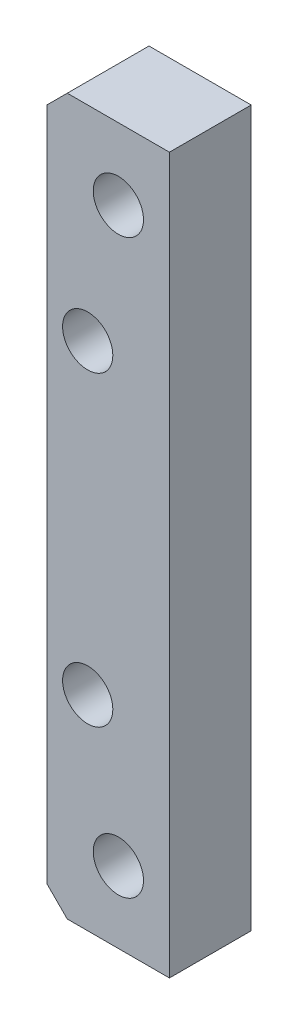
ISO-10303-21;
HEADER;
FILE_DESCRIPTION(('STEP AP214'),'2;1');
FILE_NAME('part.step','',(''),(''),'','','');
FILE_SCHEMA(('AUTOMOTIVE_DESIGN { 1 0 10303 214 1 1 1 1 }'));
ENDSEC;
DATA;
#1=APPLICATION_CONTEXT('core data for automotive mechanical design processes');
#2=APPLICATION_PROTOCOL_DEFINITION('international standard','automotive_design',2000,#1);
#3=PRODUCT_CONTEXT('',#1,'mechanical');
#4=PRODUCT('Part','Part','',(#3));
#5=PRODUCT_RELATED_PRODUCT_CATEGORY('part','',(#4));
#6=PRODUCT_DEFINITION_FORMATION('','',#4);
#7=PRODUCT_DEFINITION_CONTEXT('part definition',#1,'design');
#8=PRODUCT_DEFINITION('design','',#6,#7);
#9=PRODUCT_DEFINITION_SHAPE('','',#8);
#10=(LENGTH_UNIT() NAMED_UNIT(*) SI_UNIT(.MILLI.,.METRE.));
#11=(NAMED_UNIT(*) PLANE_ANGLE_UNIT() SI_UNIT($,.RADIAN.));
#12=(NAMED_UNIT(*) SI_UNIT($,.STERADIAN.) SOLID_ANGLE_UNIT());
#13=UNCERTAINTY_MEASURE_WITH_UNIT(LENGTH_MEASURE(1.E-05),#10,'distance_accuracy_value','');
#14=(GEOMETRIC_REPRESENTATION_CONTEXT(3) GLOBAL_UNCERTAINTY_ASSIGNED_CONTEXT((#13)) GLOBAL_UNIT_ASSIGNED_CONTEXT((#10,
#11,#12)) REPRESENTATION_CONTEXT('',''));
#15=CARTESIAN_POINT('',(0.,0.,0.));
#16=DIRECTION('',(0.,0.,1.));
#17=DIRECTION('',(1.,0.,0.));
#18=AXIS2_PLACEMENT_3D('',#15,#16,#17);
#19=CARTESIAN_POINT('',(-2.5,-17.,0.));
#20=DIRECTION('',(-0.707106781186548,-0.707106781186547,0.));
#21=DIRECTION('',(0.707106781186547,-0.707106781186548,0.));
#22=AXIS2_PLACEMENT_3D('',#19,#20,#21);
#23=PLANE('',#22);
#24=DIRECTION('',(0.707106781186547,-0.707106781186548,0.));
#25=VECTOR('',#24,1.);
#26=CARTESIAN_POINT('',(-3.,-16.5,0.));
#27=LINE('',#26,#25);
#28=CARTESIAN_POINT('',(-3.,-16.5,0.));
#29=VERTEX_POINT('',#28);
#30=CARTESIAN_POINT('',(-2.,-17.5,0.));
#31=VERTEX_POINT('',#30);
#32=EDGE_CURVE('E67',#29,#31,#27,.T.);
#33=ORIENTED_EDGE('',*,*,#32,.T.);
#34=DIRECTION('',(0.,0.,-1.));
#35=VECTOR('',#34,1.);
#36=CARTESIAN_POINT('',(-2.,-17.5,0.));
#37=LINE('',#36,#35);
#38=CARTESIAN_POINT('',(-2.,-17.5,4.));
#39=VERTEX_POINT('',#38);
#40=EDGE_CURVE('E137',#39,#31,#37,.T.);
#41=ORIENTED_EDGE('',*,*,#40,.F.);
#42=DIRECTION('',(0.707106781186547,-0.707106781186548,0.));
#43=VECTOR('',#42,1.);
#44=CARTESIAN_POINT('',(-2.5,-17.,4.));
#45=LINE('',#44,#43);
#46=CARTESIAN_POINT('',(-3.,-16.5,4.));
#47=VERTEX_POINT('',#46);
#48=EDGE_CURVE('E99',#39,#47,#45,.F.);
#49=ORIENTED_EDGE('',*,*,#48,.T.);
#50=DIRECTION('',(0.,0.,1.));
#51=VECTOR('',#50,1.);
#52=CARTESIAN_POINT('',(-3.,-16.5,0.));
#53=LINE('',#52,#51);
#54=EDGE_CURVE('E88',#29,#47,#53,.T.);
#55=ORIENTED_EDGE('',*,*,#54,.F.);
#56=EDGE_LOOP('',(#33,#41,#49,#55));
#57=FACE_BOUND('',#56,.T.);
#58=ADVANCED_FACE('F17',(#57),#23,.T.);
#59=CARTESIAN_POINT('',(-2.5,17.,0.));
#60=DIRECTION('',(-0.707106781186548,0.707106781186547,0.));
#61=DIRECTION('',(-0.707106781186547,-0.707106781186548,0.));
#62=AXIS2_PLACEMENT_3D('',#59,#60,#61);
#63=PLANE('',#62);
#64=DIRECTION('',(-0.707106781186547,-0.707106781186548,0.));
#65=VECTOR('',#64,1.);
#66=CARTESIAN_POINT('',(-2.,17.5,0.));
#67=LINE('',#66,#65);
#68=CARTESIAN_POINT('',(-2.,17.5,0.));
#69=VERTEX_POINT('',#68);
#70=CARTESIAN_POINT('',(-3.,16.5,0.));
#71=VERTEX_POINT('',#70);
#72=EDGE_CURVE('E73',#69,#71,#67,.T.);
#73=ORIENTED_EDGE('',*,*,#72,.T.);
#74=DIRECTION('',(0.,0.,1.));
#75=VECTOR('',#74,1.);
#76=CARTESIAN_POINT('',(-3.,16.5,0.));
#77=LINE('',#76,#75);
#78=CARTESIAN_POINT('',(-3.,16.5,4.));
#79=VERTEX_POINT('',#78);
#80=EDGE_CURVE('E76',#79,#71,#77,.F.);
#81=ORIENTED_EDGE('',*,*,#80,.F.);
#82=DIRECTION('',(-0.707106781186547,-0.707106781186548,0.));
#83=VECTOR('',#82,1.);
#84=CARTESIAN_POINT('',(-2.5,17.,4.));
#85=LINE('',#84,#83);
#86=CARTESIAN_POINT('',(-2.,17.5,4.));
#87=VERTEX_POINT('',#86);
#88=EDGE_CURVE('E97',#79,#87,#85,.F.);
#89=ORIENTED_EDGE('',*,*,#88,.T.);
#90=DIRECTION('',(0.,0.,1.));
#91=VECTOR('',#90,1.);
#92=CARTESIAN_POINT('',(-2.,17.5,0.));
#93=LINE('',#92,#91);
#94=EDGE_CURVE('E79',#69,#87,#93,.T.);
#95=ORIENTED_EDGE('',*,*,#94,.F.);
#96=EDGE_LOOP('',(#73,#81,#89,#95));
#97=FACE_BOUND('',#96,.T.);
#98=ADVANCED_FACE('F74',(#97),#63,.T.);
#99=CARTESIAN_POINT('',(0.,0.,0.));
#100=DIRECTION('',(0.,0.,1.));
#101=DIRECTION('',(1.,0.,0.));
#102=AXIS2_PLACEMENT_3D('',#99,#100,#101);
#103=PLANE('',#102);
#104=CARTESIAN_POINT('',(0.499999999999998,-14.,0.));
#105=DIRECTION('',(0.,0.,1.));
#106=DIRECTION('',(1.,0.,0.));
#107=AXIS2_PLACEMENT_3D('',#104,#105,#106);
#108=CIRCLE('',#107,1.2295);
#109=CARTESIAN_POINT('',(1.7295,-14.,0.));
#110=VERTEX_POINT('',#109);
#111=EDGE_CURVE('E110',#110,#110,#108,.T.);
#112=ORIENTED_EDGE('',*,*,#111,.T.);
#113=EDGE_LOOP('',(#112));
#114=FACE_BOUND('',#113,.T.);
#115=CARTESIAN_POINT('',(0.499999999999998,14.,0.));
#116=DIRECTION('',(0.,0.,1.));
#117=DIRECTION('',(1.,0.,0.));
#118=AXIS2_PLACEMENT_3D('',#115,#116,#117);
#119=CIRCLE('',#118,1.2295);
#120=CARTESIAN_POINT('',(1.7295,14.,0.));
#121=VERTEX_POINT('',#120);
#122=EDGE_CURVE('E113',#121,#121,#119,.T.);
#123=ORIENTED_EDGE('',*,*,#122,.T.);
#124=EDGE_LOOP('',(#123));
#125=FACE_BOUND('',#124,.T.);
#126=CARTESIAN_POINT('',(-1.,-7.5,0.));
#127=DIRECTION('',(0.,0.,1.));
#128=DIRECTION('',(1.,0.,0.));
#129=AXIS2_PLACEMENT_3D('',#126,#127,#128);
#130=CIRCLE('',#129,1.2295);
#131=CARTESIAN_POINT('',(0.2295,-7.5,0.));
#132=VERTEX_POINT('',#131);
#133=EDGE_CURVE('E115',#132,#132,#130,.T.);
#134=ORIENTED_EDGE('',*,*,#133,.T.);
#135=EDGE_LOOP('',(#134));
#136=FACE_BOUND('',#135,.T.);
#137=CARTESIAN_POINT('',(-1.,7.5,0.));
#138=DIRECTION('',(0.,0.,1.));
#139=DIRECTION('',(1.,0.,0.));
#140=AXIS2_PLACEMENT_3D('',#137,#138,#139);
#141=CIRCLE('',#140,1.2295);
#142=CARTESIAN_POINT('',(0.2295,7.5,0.));
#143=VERTEX_POINT('',#142);
#144=EDGE_CURVE('E20',#143,#143,#141,.T.);
#145=ORIENTED_EDGE('',*,*,#144,.T.);
#146=EDGE_LOOP('',(#145));
#147=FACE_BOUND('',#146,.T.);
#148=DIRECTION('',(1.,0.,0.));
#149=VECTOR('',#148,1.);
#150=CARTESIAN_POINT('',(-3.,17.5,0.));
#151=LINE('',#150,#149);
#152=CARTESIAN_POINT('',(3.,17.5,0.));
#153=VERTEX_POINT('',#152);
#154=EDGE_CURVE('E120',#153,#69,#151,.F.);
#155=ORIENTED_EDGE('',*,*,#154,.F.);
#156=DIRECTION('',(0.,1.,0.));
#157=VECTOR('',#156,1.);
#158=CARTESIAN_POINT('',(3.,17.5,0.));
#159=LINE('',#158,#157);
#160=CARTESIAN_POINT('',(3.,-17.5,0.));
#161=VERTEX_POINT('',#160);
#162=EDGE_CURVE('E130',#161,#153,#159,.T.);
#163=ORIENTED_EDGE('',*,*,#162,.F.);
#164=DIRECTION('',(1.,0.,0.));
#165=VECTOR('',#164,1.);
#166=CARTESIAN_POINT('',(3.,-17.5,0.));
#167=LINE('',#166,#165);
#168=EDGE_CURVE('E135',#31,#161,#167,.T.);
#169=ORIENTED_EDGE('',*,*,#168,.F.);
#170=ORIENTED_EDGE('',*,*,#32,.F.);
#171=DIRECTION('',(0.,1.,0.));
#172=VECTOR('',#171,1.);
#173=CARTESIAN_POINT('',(-3.,-17.5,0.));
#174=LINE('',#173,#172);
#175=EDGE_CURVE('E84',#71,#29,#174,.F.);
#176=ORIENTED_EDGE('',*,*,#175,.F.);
#177=ORIENTED_EDGE('',*,*,#72,.F.);
#178=EDGE_LOOP('',(#155,#163,#169,#170,#176,#177));
#179=FACE_BOUND('',#178,.T.);
#180=ADVANCED_FACE('F85',(#114,#125,#136,#147,#179),#103,.F.);
#181=CARTESIAN_POINT('',(-3.,-17.5,0.));
#182=DIRECTION('',(-1.,0.,0.));
#183=DIRECTION('',(0.,0.,1.));
#184=AXIS2_PLACEMENT_3D('',#181,#182,#183);
#185=PLANE('',#184);
#186=ORIENTED_EDGE('',*,*,#54,.T.);
#187=DIRECTION('',(0.,1.,0.));
#188=VECTOR('',#187,1.);
#189=CARTESIAN_POINT('',(-3.,0.,4.));
#190=LINE('',#189,#188);
#191=EDGE_CURVE('E92',#79,#47,#190,.F.);
#192=ORIENTED_EDGE('',*,*,#191,.F.);
#193=ORIENTED_EDGE('',*,*,#80,.T.);
#194=ORIENTED_EDGE('',*,*,#175,.T.);
#195=EDGE_LOOP('',(#186,#192,#193,#194));
#196=FACE_BOUND('',#195,.T.);
#197=ADVANCED_FACE('F90',(#196),#185,.T.);
#198=CARTESIAN_POINT('',(3.,-17.5,0.));
#199=DIRECTION('',(0.,-1.,0.));
#200=DIRECTION('',(0.,0.,-1.));
#201=AXIS2_PLACEMENT_3D('',#198,#199,#200);
#202=PLANE('',#201);
#203=DIRECTION('',(0.,0.,-1.));
#204=VECTOR('',#203,1.);
#205=CARTESIAN_POINT('',(3.,-17.5,0.));
#206=LINE('',#205,#204);
#207=CARTESIAN_POINT('',(3.,-17.5,4.));
#208=VERTEX_POINT('',#207);
#209=EDGE_CURVE('E132',#208,#161,#206,.T.);
#210=ORIENTED_EDGE('',*,*,#209,.F.);
#211=DIRECTION('',(1.,0.,0.));
#212=VECTOR('',#211,1.);
#213=CARTESIAN_POINT('',(0.,-17.5,4.));
#214=LINE('',#213,#212);
#215=EDGE_CURVE('E146',#39,#208,#214,.T.);
#216=ORIENTED_EDGE('',*,*,#215,.F.);
#217=ORIENTED_EDGE('',*,*,#40,.T.);
#218=ORIENTED_EDGE('',*,*,#168,.T.);
#219=EDGE_LOOP('',(#210,#216,#217,#218));
#220=FACE_BOUND('',#219,.T.);
#221=ADVANCED_FACE('F164',(#220),#202,.T.);
#222=CARTESIAN_POINT('',(3.,17.5,0.));
#223=DIRECTION('',(1.,0.,0.));
#224=DIRECTION('',(0.,0.,-1.));
#225=AXIS2_PLACEMENT_3D('',#222,#223,#224);
#226=PLANE('',#225);
#227=ORIENTED_EDGE('',*,*,#162,.T.);
#228=DIRECTION('',(0.,0.,1.));
#229=VECTOR('',#228,1.);
#230=CARTESIAN_POINT('',(3.,17.5,0.));
#231=LINE('',#230,#229);
#232=CARTESIAN_POINT('',(3.,17.5,4.));
#233=VERTEX_POINT('',#232);
#234=EDGE_CURVE('E35',#233,#153,#231,.F.);
#235=ORIENTED_EDGE('',*,*,#234,.F.);
#236=DIRECTION('',(0.,1.,0.));
#237=VECTOR('',#236,1.);
#238=CARTESIAN_POINT('',(3.,0.,4.));
#239=LINE('',#238,#237);
#240=EDGE_CURVE('E147',#208,#233,#239,.T.);
#241=ORIENTED_EDGE('',*,*,#240,.F.);
#242=ORIENTED_EDGE('',*,*,#209,.T.);
#243=EDGE_LOOP('',(#227,#235,#241,#242));
#244=FACE_BOUND('',#243,.T.);
#245=ADVANCED_FACE('F154',(#244),#226,.T.);
#246=CARTESIAN_POINT('',(-3.,17.5,0.));
#247=DIRECTION('',(0.,1.,0.));
#248=DIRECTION('',(0.,0.,1.));
#249=AXIS2_PLACEMENT_3D('',#246,#247,#248);
#250=PLANE('',#249);
#251=ORIENTED_EDGE('',*,*,#234,.T.);
#252=ORIENTED_EDGE('',*,*,#154,.T.);
#253=ORIENTED_EDGE('',*,*,#94,.T.);
#254=DIRECTION('',(1.,0.,0.));
#255=VECTOR('',#254,1.);
#256=CARTESIAN_POINT('',(0.,17.5,4.));
#257=LINE('',#256,#255);
#258=EDGE_CURVE('E109',#233,#87,#257,.F.);
#259=ORIENTED_EDGE('',*,*,#258,.F.);
#260=EDGE_LOOP('',(#251,#252,#253,#259));
#261=FACE_BOUND('',#260,.T.);
#262=ADVANCED_FACE('F151',(#261),#250,.T.);
#263=CARTESIAN_POINT('',(-1.,7.5,0.));
#264=DIRECTION('',(0.,0.,1.));
#265=DIRECTION('',(1.,0.,0.));
#266=AXIS2_PLACEMENT_3D('',#263,#264,#265);
#267=CYLINDRICAL_SURFACE('',#266,1.2295);
#268=CARTESIAN_POINT('',(-1.,7.5,4.));
#269=DIRECTION('',(0.,0.,1.));
#270=DIRECTION('',(1.,0.,0.));
#271=AXIS2_PLACEMENT_3D('',#268,#269,#270);
#272=CIRCLE('',#271,1.2295);
#273=CARTESIAN_POINT('',(0.2295,7.5,4.));
#274=VERTEX_POINT('',#273);
#275=EDGE_CURVE('E106',#274,#274,#272,.F.);
#276=ORIENTED_EDGE('',*,*,#275,.F.);
#277=EDGE_LOOP('',(#276));
#278=FACE_BOUND('',#277,.T.);
#279=ORIENTED_EDGE('',*,*,#144,.F.);
#280=EDGE_LOOP('',(#279));
#281=FACE_BOUND('',#280,.T.);
#282=ADVANCED_FACE('F153',(#278,#281),#267,.F.);
#283=CARTESIAN_POINT('',(-1.,-7.5,0.));
#284=DIRECTION('',(0.,0.,1.));
#285=DIRECTION('',(1.,0.,0.));
#286=AXIS2_PLACEMENT_3D('',#283,#284,#285);
#287=CYLINDRICAL_SURFACE('',#286,1.2295);
#288=CARTESIAN_POINT('',(-1.,-7.5,4.));
#289=DIRECTION('',(0.,0.,1.));
#290=DIRECTION('',(1.,0.,0.));
#291=AXIS2_PLACEMENT_3D('',#288,#289,#290);
#292=CIRCLE('',#291,1.2295);
#293=CARTESIAN_POINT('',(0.2295,-7.5,4.));
#294=VERTEX_POINT('',#293);
#295=EDGE_CURVE('E103',#294,#294,#292,.F.);
#296=ORIENTED_EDGE('',*,*,#295,.F.);
#297=EDGE_LOOP('',(#296));
#298=FACE_BOUND('',#297,.T.);
#299=ORIENTED_EDGE('',*,*,#133,.F.);
#300=EDGE_LOOP('',(#299));
#301=FACE_BOUND('',#300,.T.);
#302=ADVANCED_FACE('F161',(#298,#301),#287,.F.);
#303=CARTESIAN_POINT('',(0.499999999999998,14.,0.));
#304=DIRECTION('',(0.,0.,1.));
#305=DIRECTION('',(1.,0.,0.));
#306=AXIS2_PLACEMENT_3D('',#303,#304,#305);
#307=CYLINDRICAL_SURFACE('',#306,1.2295);
#308=CARTESIAN_POINT('',(0.499999999999998,14.,4.));
#309=DIRECTION('',(0.,0.,1.));
#310=DIRECTION('',(1.,0.,0.));
#311=AXIS2_PLACEMENT_3D('',#308,#309,#310);
#312=CIRCLE('',#311,1.2295);
#313=CARTESIAN_POINT('',(1.7295,14.,4.));
#314=VERTEX_POINT('',#313);
#315=EDGE_CURVE('E26',#314,#314,#312,.F.);
#316=ORIENTED_EDGE('',*,*,#315,.F.);
#317=EDGE_LOOP('',(#316));
#318=FACE_BOUND('',#317,.T.);
#319=ORIENTED_EDGE('',*,*,#122,.F.);
#320=EDGE_LOOP('',(#319));
#321=FACE_BOUND('',#320,.T.);
#322=ADVANCED_FACE('F173',(#318,#321),#307,.F.);
#323=CARTESIAN_POINT('',(0.499999999999998,-14.,0.));
#324=DIRECTION('',(0.,0.,1.));
#325=DIRECTION('',(1.,0.,0.));
#326=AXIS2_PLACEMENT_3D('',#323,#324,#325);
#327=CYLINDRICAL_SURFACE('',#326,1.2295);
#328=CARTESIAN_POINT('',(0.499999999999998,-14.,4.));
#329=DIRECTION('',(0.,0.,1.));
#330=DIRECTION('',(1.,0.,0.));
#331=AXIS2_PLACEMENT_3D('',#328,#329,#330);
#332=CIRCLE('',#331,1.2295);
#333=CARTESIAN_POINT('',(1.7295,-14.,4.));
#334=VERTEX_POINT('',#333);
#335=EDGE_CURVE('E11',#334,#334,#332,.F.);
#336=ORIENTED_EDGE('',*,*,#335,.F.);
#337=EDGE_LOOP('',(#336));
#338=FACE_BOUND('',#337,.T.);
#339=ORIENTED_EDGE('',*,*,#111,.F.);
#340=EDGE_LOOP('',(#339));
#341=FACE_BOUND('',#340,.T.);
#342=ADVANCED_FACE('F167',(#338,#341),#327,.F.);
#343=CARTESIAN_POINT('',(0.,0.,4.));
#344=DIRECTION('',(0.,0.,1.));
#345=DIRECTION('',(1.,0.,0.));
#346=AXIS2_PLACEMENT_3D('',#343,#344,#345);
#347=PLANE('',#346);
#348=ORIENTED_EDGE('',*,*,#335,.T.);
#349=EDGE_LOOP('',(#348));
#350=FACE_BOUND('',#349,.T.);
#351=ORIENTED_EDGE('',*,*,#315,.T.);
#352=EDGE_LOOP('',(#351));
#353=FACE_BOUND('',#352,.T.);
#354=ORIENTED_EDGE('',*,*,#295,.T.);
#355=EDGE_LOOP('',(#354));
#356=FACE_BOUND('',#355,.T.);
#357=ORIENTED_EDGE('',*,*,#275,.T.);
#358=EDGE_LOOP('',(#357));
#359=FACE_BOUND('',#358,.T.);
#360=ORIENTED_EDGE('',*,*,#240,.T.);
#361=ORIENTED_EDGE('',*,*,#258,.T.);
#362=ORIENTED_EDGE('',*,*,#88,.F.);
#363=ORIENTED_EDGE('',*,*,#191,.T.);
#364=ORIENTED_EDGE('',*,*,#48,.F.);
#365=ORIENTED_EDGE('',*,*,#215,.T.);
#366=EDGE_LOOP('',(#360,#361,#362,#363,#364,#365));
#367=FACE_BOUND('',#366,.T.);
#368=ADVANCED_FACE('F142',(#350,#353,#356,#359,#367),#347,.T.);
#369=CLOSED_SHELL('',(#58,#98,#180,#197,#221,#245,#262,#282,#302,#322,#342,#368));
#370=MANIFOLD_SOLID_BREP('B1',#369);
#371=ADVANCED_BREP_SHAPE_REPRESENTATION('',(#18,#370),#14);
#372=SHAPE_DEFINITION_REPRESENTATION(#9,#371);
ENDSEC;
END-ISO-10303-21;
